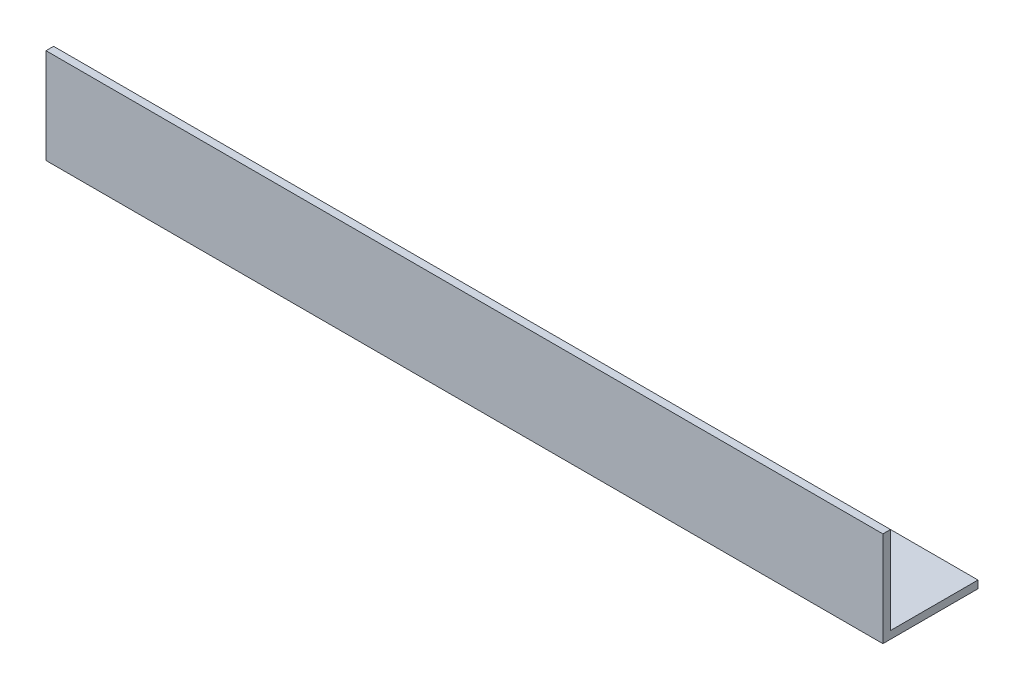
ISO-10303-21;
HEADER;
FILE_DESCRIPTION(('STEP AP214'),'2;1');
FILE_NAME('part.step','',(''),(''),'','','');
FILE_SCHEMA(('AUTOMOTIVE_DESIGN { 1 0 10303 214 1 1 1 1 }'));
ENDSEC;
DATA;
#1=APPLICATION_CONTEXT('core data for automotive mechanical design processes');
#2=APPLICATION_PROTOCOL_DEFINITION('international standard','automotive_design',2000,#1);
#3=PRODUCT_CONTEXT('',#1,'mechanical');
#4=PRODUCT('Part','Part','',(#3));
#5=PRODUCT_RELATED_PRODUCT_CATEGORY('part','',(#4));
#6=PRODUCT_DEFINITION_FORMATION('','',#4);
#7=PRODUCT_DEFINITION_CONTEXT('part definition',#1,'design');
#8=PRODUCT_DEFINITION('design','',#6,#7);
#9=PRODUCT_DEFINITION_SHAPE('','',#8);
#10=(LENGTH_UNIT() NAMED_UNIT(*) SI_UNIT(.MILLI.,.METRE.));
#11=(NAMED_UNIT(*) PLANE_ANGLE_UNIT() SI_UNIT($,.RADIAN.));
#12=(NAMED_UNIT(*) SI_UNIT($,.STERADIAN.) SOLID_ANGLE_UNIT());
#13=UNCERTAINTY_MEASURE_WITH_UNIT(LENGTH_MEASURE(1.E-05),#10,'distance_accuracy_value','');
#14=(GEOMETRIC_REPRESENTATION_CONTEXT(3) GLOBAL_UNCERTAINTY_ASSIGNED_CONTEXT((#13)) GLOBAL_UNIT_ASSIGNED_CONTEXT((#10,
#11,#12)) REPRESENTATION_CONTEXT('',''));
#15=CARTESIAN_POINT('',(0.,0.,0.));
#16=DIRECTION('',(0.,0.,1.));
#17=DIRECTION('',(1.,0.,0.));
#18=AXIS2_PLACEMENT_3D('',#15,#16,#17);
#19=CARTESIAN_POINT('',(220.,2.,-25.));
#20=DIRECTION('',(0.,0.,-1.));
#21=DIRECTION('',(-1.,0.,0.));
#22=AXIS2_PLACEMENT_3D('',#19,#20,#21);
#23=PLANE('',#22);
#24=DIRECTION('',(0.,-1.,0.));
#25=VECTOR('',#24,1.);
#26=CARTESIAN_POINT('',(31.8984433861517,25.,-25.));
#27=LINE('',#26,#25);
#28=CARTESIAN_POINT('',(31.8984433861517,2.,-25.));
#29=VERTEX_POINT('',#28);
#30=CARTESIAN_POINT('',(31.8984433861517,0.,-25.));
#31=VERTEX_POINT('',#30);
#32=EDGE_CURVE('E173',#29,#31,#27,.T.);
#33=ORIENTED_EDGE('',*,*,#32,.F.);
#34=DIRECTION('',(-1.,0.,0.));
#35=VECTOR('',#34,1.);
#36=CARTESIAN_POINT('',(220.,2.,-25.));
#37=LINE('',#36,#35);
#38=CARTESIAN_POINT('',(40.,2.,-25.));
#39=VERTEX_POINT('',#38);
#40=EDGE_CURVE('E205',#39,#29,#37,.T.);
#41=ORIENTED_EDGE('',*,*,#40,.F.);
#42=DIRECTION('',(0.,-1.,0.));
#43=VECTOR('',#42,1.);
#44=CARTESIAN_POINT('',(40.,25.,-25.));
#45=LINE('',#44,#43);
#46=CARTESIAN_POINT('',(40.,0.,-25.));
#47=VERTEX_POINT('',#46);
#48=EDGE_CURVE('E195',#39,#47,#45,.T.);
#49=ORIENTED_EDGE('',*,*,#48,.T.);
#50=DIRECTION('',(-1.,0.,0.));
#51=VECTOR('',#50,1.);
#52=CARTESIAN_POINT('',(220.,0.,-25.));
#53=LINE('',#52,#51);
#54=EDGE_CURVE('E191',#47,#31,#53,.T.);
#55=ORIENTED_EDGE('',*,*,#54,.T.);
#56=EDGE_LOOP('',(#33,#41,#49,#55));
#57=FACE_BOUND('',#56,.T.);
#58=ADVANCED_FACE('F37',(#57),#23,.T.);
#59=DIRECTION('',(0.,-1.,0.));
#60=VECTOR('',#59,1.);
#61=CARTESIAN_POINT('',(71.8984433861517,25.,-25.));
#62=LINE('',#61,#60);
#63=CARTESIAN_POINT('',(71.8984433861517,2.,-25.));
#64=VERTEX_POINT('',#63);
#65=CARTESIAN_POINT('',(71.8984433861517,0.,-25.));
#66=VERTEX_POINT('',#65);
#67=EDGE_CURVE('E361',#64,#66,#62,.T.);
#68=ORIENTED_EDGE('',*,*,#67,.F.);
#69=CARTESIAN_POINT('',(80.,2.,-25.));
#70=VERTEX_POINT('',#69);
#71=EDGE_CURVE('E308',#70,#64,#37,.T.);
#72=ORIENTED_EDGE('',*,*,#71,.F.);
#73=DIRECTION('',(0.,-1.,0.));
#74=VECTOR('',#73,1.);
#75=CARTESIAN_POINT('',(80.,25.,-25.));
#76=LINE('',#75,#74);
#77=CARTESIAN_POINT('',(80.,0.,-25.));
#78=VERTEX_POINT('',#77);
#79=EDGE_CURVE('E253',#70,#78,#76,.T.);
#80=ORIENTED_EDGE('',*,*,#79,.T.);
#81=EDGE_CURVE('E196',#78,#66,#53,.T.);
#82=ORIENTED_EDGE('',*,*,#81,.T.);
#83=EDGE_LOOP('',(#68,#72,#80,#82));
#84=FACE_BOUND('',#83,.T.);
#85=ADVANCED_FACE('F371',(#84),#23,.T.);
#86=DIRECTION('',(0.,-1.,0.));
#87=VECTOR('',#86,1.);
#88=CARTESIAN_POINT('',(111.898443386152,25.,-25.));
#89=LINE('',#88,#87);
#90=CARTESIAN_POINT('',(111.898443386152,2.,-25.));
#91=VERTEX_POINT('',#90);
#92=CARTESIAN_POINT('',(111.898443386152,0.,-25.));
#93=VERTEX_POINT('',#92);
#94=EDGE_CURVE('E227',#91,#93,#89,.T.);
#95=ORIENTED_EDGE('',*,*,#94,.F.);
#96=CARTESIAN_POINT('',(120.,2.,-25.));
#97=VERTEX_POINT('',#96);
#98=EDGE_CURVE('E312',#97,#91,#37,.T.);
#99=ORIENTED_EDGE('',*,*,#98,.F.);
#100=DIRECTION('',(0.,-1.,0.));
#101=VECTOR('',#100,1.);
#102=CARTESIAN_POINT('',(120.,25.,-25.));
#103=LINE('',#102,#101);
#104=CARTESIAN_POINT('',(120.,0.,-25.));
#105=VERTEX_POINT('',#104);
#106=EDGE_CURVE('E229',#97,#105,#103,.T.);
#107=ORIENTED_EDGE('',*,*,#106,.T.);
#108=EDGE_CURVE('E201',#105,#93,#53,.T.);
#109=ORIENTED_EDGE('',*,*,#108,.T.);
#110=EDGE_LOOP('',(#95,#99,#107,#109));
#111=FACE_BOUND('',#110,.T.);
#112=ADVANCED_FACE('F225',(#111),#23,.T.);
#113=DIRECTION('',(0.,-1.,0.));
#114=VECTOR('',#113,1.);
#115=CARTESIAN_POINT('',(151.898443386152,25.,-25.));
#116=LINE('',#115,#114);
#117=CARTESIAN_POINT('',(151.898443386152,2.,-25.));
#118=VERTEX_POINT('',#117);
#119=CARTESIAN_POINT('',(151.898443386152,0.,-25.));
#120=VERTEX_POINT('',#119);
#121=EDGE_CURVE('E243',#118,#120,#116,.T.);
#122=ORIENTED_EDGE('',*,*,#121,.F.);
#123=CARTESIAN_POINT('',(160.,2.,-25.));
#124=VERTEX_POINT('',#123);
#125=EDGE_CURVE('E203',#124,#118,#37,.T.);
#126=ORIENTED_EDGE('',*,*,#125,.F.);
#127=DIRECTION('',(0.,-1.,0.));
#128=VECTOR('',#127,1.);
#129=CARTESIAN_POINT('',(160.,25.,-25.));
#130=LINE('',#129,#128);
#131=CARTESIAN_POINT('',(160.,0.,-25.));
#132=VERTEX_POINT('',#131);
#133=EDGE_CURVE('E259',#124,#132,#130,.T.);
#134=ORIENTED_EDGE('',*,*,#133,.T.);
#135=EDGE_CURVE('E209',#132,#120,#53,.T.);
#136=ORIENTED_EDGE('',*,*,#135,.T.);
#137=EDGE_LOOP('',(#122,#126,#134,#136));
#138=FACE_BOUND('',#137,.T.);
#139=ADVANCED_FACE('F327',(#138),#23,.T.);
#140=CARTESIAN_POINT('',(220.,0.,0.));
#141=DIRECTION('',(0.,1.,0.));
#142=DIRECTION('',(0.,0.,1.));
#143=AXIS2_PLACEMENT_3D('',#140,#141,#142);
#144=PLANE('',#143);
#145=DIRECTION('',(0.,0.,-1.));
#146=VECTOR('',#145,1.);
#147=CARTESIAN_POINT('',(0.,0.,0.));
#148=LINE('',#147,#146);
#149=CARTESIAN_POINT('',(0.,0.,0.));
#150=VERTEX_POINT('',#149);
#151=CARTESIAN_POINT('',(0.,0.,-25.));
#152=VERTEX_POINT('',#151);
#153=EDGE_CURVE('E266',#150,#152,#148,.T.);
#154=ORIENTED_EDGE('',*,*,#153,.T.);
#155=DIRECTION('',(-0.904526644147777,0.,-0.426417108037144));
#156=VECTOR('',#155,1.);
#157=CARTESIAN_POINT('',(0.,0.,-25.));
#158=LINE('',#157,#156);
#159=CARTESIAN_POINT('',(14.4449828570791,0.,-18.1902638187456));
#160=VERTEX_POINT('',#159);
#161=EDGE_CURVE('E185',#160,#152,#158,.T.);
#162=ORIENTED_EDGE('',*,*,#161,.F.);
#163=DIRECTION('',(-0.931602389264283,0.,0.363479006707511));
#164=VECTOR('',#163,1.);
#165=CARTESIAN_POINT('',(14.4449828570791,0.,-18.1902638187456));
#166=LINE('',#165,#164);
#167=EDGE_CURVE('E177',#31,#160,#166,.T.);
#168=ORIENTED_EDGE('',*,*,#167,.F.);
#169=ORIENTED_EDGE('',*,*,#54,.F.);
#170=DIRECTION('',(-0.904526644147777,0.,-0.426417108037144));
#171=VECTOR('',#170,1.);
#172=CARTESIAN_POINT('',(40.,0.,-25.));
#173=LINE('',#172,#171);
#174=CARTESIAN_POINT('',(54.4449828570791,0.,-18.1902638187456));
#175=VERTEX_POINT('',#174);
#176=EDGE_CURVE('E363',#175,#47,#173,.T.);
#177=ORIENTED_EDGE('',*,*,#176,.F.);
#178=DIRECTION('',(-0.931602389264283,0.,0.363479006707511));
#179=VECTOR('',#178,1.);
#180=CARTESIAN_POINT('',(54.4449828570791,0.,-18.1902638187456));
#181=LINE('',#180,#179);
#182=EDGE_CURVE('E192',#66,#175,#181,.T.);
#183=ORIENTED_EDGE('',*,*,#182,.F.);
#184=ORIENTED_EDGE('',*,*,#81,.F.);
#185=DIRECTION('',(-0.904526644147777,0.,-0.426417108037144));
#186=VECTOR('',#185,1.);
#187=CARTESIAN_POINT('',(80.,0.,-25.));
#188=LINE('',#187,#186);
#189=CARTESIAN_POINT('',(94.4449828570791,0.,-18.1902638187456));
#190=VERTEX_POINT('',#189);
#191=EDGE_CURVE('E237',#190,#78,#188,.T.);
#192=ORIENTED_EDGE('',*,*,#191,.F.);
#193=DIRECTION('',(-0.931602389264283,0.,0.363479006707511));
#194=VECTOR('',#193,1.);
#195=CARTESIAN_POINT('',(94.4449828570791,0.,-18.1902638187456));
#196=LINE('',#195,#194);
#197=EDGE_CURVE('E235',#93,#190,#196,.T.);
#198=ORIENTED_EDGE('',*,*,#197,.F.);
#199=ORIENTED_EDGE('',*,*,#108,.F.);
#200=DIRECTION('',(-0.904526644147777,0.,-0.426417108037144));
#201=VECTOR('',#200,1.);
#202=CARTESIAN_POINT('',(120.,0.,-25.));
#203=LINE('',#202,#201);
#204=CARTESIAN_POINT('',(134.444982857079,0.,-18.1902638187456));
#205=VERTEX_POINT('',#204);
#206=EDGE_CURVE('E233',#205,#105,#203,.T.);
#207=ORIENTED_EDGE('',*,*,#206,.F.);
#208=DIRECTION('',(-0.931602389264283,0.,0.363479006707511));
#209=VECTOR('',#208,1.);
#210=CARTESIAN_POINT('',(134.444982857079,0.,-18.1902638187456));
#211=LINE('',#210,#209);
#212=EDGE_CURVE('E250',#120,#205,#211,.T.);
#213=ORIENTED_EDGE('',*,*,#212,.F.);
#214=ORIENTED_EDGE('',*,*,#135,.F.);
#215=DIRECTION('',(-0.904526644147777,0.,-0.426417108037144));
#216=VECTOR('',#215,1.);
#217=CARTESIAN_POINT('',(160.,0.,-25.));
#218=LINE('',#217,#216);
#219=CARTESIAN_POINT('',(174.444982857079,0.,-18.1902638187456));
#220=VERTEX_POINT('',#219);
#221=EDGE_CURVE('E256',#220,#132,#218,.T.);
#222=ORIENTED_EDGE('',*,*,#221,.F.);
#223=DIRECTION('',(-0.931602389264283,0.,0.363479006707511));
#224=VECTOR('',#223,1.);
#225=CARTESIAN_POINT('',(174.444982857079,0.,-18.1902638187456));
#226=LINE('',#225,#224);
#227=CARTESIAN_POINT('',(191.898443386152,0.,-25.));
#228=VERTEX_POINT('',#227);
#229=EDGE_CURVE('E248',#228,#220,#226,.T.);
#230=ORIENTED_EDGE('',*,*,#229,.F.);
#231=CARTESIAN_POINT('',(220.,0.,-25.));
#232=VERTEX_POINT('',#231);
#233=EDGE_CURVE('E199',#232,#228,#53,.T.);
#234=ORIENTED_EDGE('',*,*,#233,.F.);
#235=DIRECTION('',(0.,0.,-1.));
#236=VECTOR('',#235,1.);
#237=CARTESIAN_POINT('',(220.,0.,0.));
#238=LINE('',#237,#236);
#239=CARTESIAN_POINT('',(220.,0.,0.));
#240=VERTEX_POINT('',#239);
#241=EDGE_CURVE('E267',#240,#232,#238,.T.);
#242=ORIENTED_EDGE('',*,*,#241,.F.);
#243=DIRECTION('',(-1.,0.,0.));
#244=VECTOR('',#243,1.);
#245=CARTESIAN_POINT('',(220.,0.,0.));
#246=LINE('',#245,#244);
#247=EDGE_CURVE('E283',#240,#150,#246,.T.);
#248=ORIENTED_EDGE('',*,*,#247,.T.);
#249=EDGE_LOOP('',(#154,#162,#168,#169,#177,#183,#184,#192,#198,#199,#207,#213,#214,#222,#230,
#234,#242,#248));
#250=FACE_BOUND('',#249,.T.);
#251=ADVANCED_FACE('F39',(#250),#144,.F.);
#252=DIRECTION('',(0.,-1.,0.));
#253=VECTOR('',#252,1.);
#254=CARTESIAN_POINT('',(191.898443386152,25.,-25.));
#255=LINE('',#254,#253);
#256=CARTESIAN_POINT('',(191.898443386152,2.,-25.));
#257=VERTEX_POINT('',#256);
#258=EDGE_CURVE('E254',#257,#228,#255,.T.);
#259=ORIENTED_EDGE('',*,*,#258,.F.);
#260=CARTESIAN_POINT('',(220.,2.,-25.));
#261=VERTEX_POINT('',#260);
#262=EDGE_CURVE('E197',#261,#257,#37,.T.);
#263=ORIENTED_EDGE('',*,*,#262,.F.);
#264=DIRECTION('',(0.,-1.,0.));
#265=VECTOR('',#264,1.);
#266=CARTESIAN_POINT('',(220.,2.,-25.));
#267=LINE('',#266,#265);
#268=EDGE_CURVE('E269',#261,#232,#267,.T.);
#269=ORIENTED_EDGE('',*,*,#268,.T.);
#270=ORIENTED_EDGE('',*,*,#233,.T.);
#271=EDGE_LOOP('',(#259,#263,#269,#270));
#272=FACE_BOUND('',#271,.T.);
#273=ADVANCED_FACE('F336',(#272),#23,.T.);
#274=CARTESIAN_POINT('',(220.,2.,0.));
#275=DIRECTION('',(0.,1.,0.));
#276=DIRECTION('',(0.,0.,1.));
#277=AXIS2_PLACEMENT_3D('',#274,#275,#276);
#278=PLANE('',#277);
#279=DIRECTION('',(0.904526644147777,0.,0.426417108037144));
#280=VECTOR('',#279,1.);
#281=CARTESIAN_POINT('',(189.639699887613,2.,64.4010286134773));
#282=LINE('',#281,#280);
#283=CARTESIAN_POINT('',(0.,2.,-25.));
#284=VERTEX_POINT('',#283);
#285=CARTESIAN_POINT('',(14.4449828570791,2.,-18.1902638187456));
#286=VERTEX_POINT('',#285);
#287=EDGE_CURVE('E264',#284,#286,#282,.T.);
#288=ORIENTED_EDGE('',*,*,#287,.F.);
#289=DIRECTION('',(0.,0.,-1.));
#290=VECTOR('',#289,1.);
#291=CARTESIAN_POINT('',(0.,2.,0.));
#292=LINE('',#291,#290);
#293=CARTESIAN_POINT('',(0.,2.,-2.));
#294=VERTEX_POINT('',#293);
#295=EDGE_CURVE('E288',#294,#284,#292,.T.);
#296=ORIENTED_EDGE('',*,*,#295,.F.);
#297=DIRECTION('',(-1.,0.,0.));
#298=VECTOR('',#297,1.);
#299=CARTESIAN_POINT('',(220.,2.,-2.));
#300=LINE('',#299,#298);
#301=CARTESIAN_POINT('',(220.,2.,-2.));
#302=VERTEX_POINT('',#301);
#303=EDGE_CURVE('E304',#302,#294,#300,.T.);
#304=ORIENTED_EDGE('',*,*,#303,.F.);
#305=DIRECTION('',(0.,0.,-1.));
#306=VECTOR('',#305,1.);
#307=CARTESIAN_POINT('',(220.,2.,0.));
#308=LINE('',#307,#306);
#309=EDGE_CURVE('E272',#302,#261,#308,.T.);
#310=ORIENTED_EDGE('',*,*,#309,.T.);
#311=ORIENTED_EDGE('',*,*,#262,.T.);
#312=DIRECTION('',(0.931602389264283,0.,-0.363479006707511));
#313=VECTOR('',#312,1.);
#314=CARTESIAN_POINT('',(207.821859195753,2.,-31.2127656912038));
#315=LINE('',#314,#313);
#316=CARTESIAN_POINT('',(174.444982857079,2.,-18.1902638187456));
#317=VERTEX_POINT('',#316);
#318=EDGE_CURVE('E208',#317,#257,#315,.T.);
#319=ORIENTED_EDGE('',*,*,#318,.F.);
#320=DIRECTION('',(0.904526644147777,0.,0.426417108037144));
#321=VECTOR('',#320,1.);
#322=CARTESIAN_POINT('',(218.732747891895,2.,2.68812689507127));
#323=LINE('',#322,#321);
#324=EDGE_CURVE('E214',#124,#317,#323,.T.);
#325=ORIENTED_EDGE('',*,*,#324,.F.);
#326=ORIENTED_EDGE('',*,*,#125,.T.);
#327=DIRECTION('',(0.931602389264283,0.,-0.363479006707511));
#328=VECTOR('',#327,1.);
#329=CARTESIAN_POINT('',(202.53717966307,2.,-44.7574821350488));
#330=LINE('',#329,#328);
#331=CARTESIAN_POINT('',(134.444982857079,2.,-18.1902638187456));
#332=VERTEX_POINT('',#331);
#333=EDGE_CURVE('E324',#332,#118,#330,.T.);
#334=ORIENTED_EDGE('',*,*,#333,.F.);
#335=DIRECTION('',(0.904526644147777,0.,0.426417108037144));
#336=VECTOR('',#335,1.);
#337=CARTESIAN_POINT('',(211.459485890825,2.,18.1163523246728));
#338=LINE('',#337,#336);
#339=EDGE_CURVE('E382',#97,#332,#338,.T.);
#340=ORIENTED_EDGE('',*,*,#339,.F.);
#341=ORIENTED_EDGE('',*,*,#98,.T.);
#342=DIRECTION('',(0.931602389264283,0.,-0.363479006707511));
#343=VECTOR('',#342,1.);
#344=CARTESIAN_POINT('',(197.252500130387,2.,-58.3021985788939));
#345=LINE('',#344,#343);
#346=CARTESIAN_POINT('',(94.4449828570791,2.,-18.1902638187455));
#347=VERTEX_POINT('',#346);
#348=EDGE_CURVE('E378',#347,#91,#345,.T.);
#349=ORIENTED_EDGE('',*,*,#348,.F.);
#350=DIRECTION('',(0.904526644147777,0.,0.426417108037144));
#351=VECTOR('',#350,1.);
#352=CARTESIAN_POINT('',(204.186223889754,2.,33.5445777542743));
#353=LINE('',#352,#351);
#354=EDGE_CURVE('E376',#70,#347,#353,.T.);
#355=ORIENTED_EDGE('',*,*,#354,.F.);
#356=ORIENTED_EDGE('',*,*,#71,.T.);
#357=DIRECTION('',(0.931602389264284,0.,-0.363479006707511));
#358=VECTOR('',#357,1.);
#359=CARTESIAN_POINT('',(191.967820597704,2.,-71.8469150227389));
#360=LINE('',#359,#358);
#361=CARTESIAN_POINT('',(54.4449828570791,2.,-18.1902638187456));
#362=VERTEX_POINT('',#361);
#363=EDGE_CURVE('E375',#362,#64,#360,.T.);
#364=ORIENTED_EDGE('',*,*,#363,.F.);
#365=DIRECTION('',(0.904526644147777,0.,0.426417108037144));
#366=VECTOR('',#365,1.);
#367=CARTESIAN_POINT('',(196.912961888684,2.,48.9728031838758));
#368=LINE('',#367,#366);
#369=EDGE_CURVE('E45',#39,#362,#368,.T.);
#370=ORIENTED_EDGE('',*,*,#369,.F.);
#371=ORIENTED_EDGE('',*,*,#40,.T.);
#372=DIRECTION('',(0.931602389264283,0.,-0.363479006707511));
#373=VECTOR('',#372,1.);
#374=CARTESIAN_POINT('',(186.683141065021,2.,-85.3916314665839));
#375=LINE('',#374,#373);
#376=EDGE_CURVE('E11',#286,#29,#375,.T.);
#377=ORIENTED_EDGE('',*,*,#376,.F.);
#378=EDGE_LOOP('',(#288,#296,#304,#310,#311,#319,#325,#326,#334,#340,#341,#349,#355,#356,#364,
#370,#371,#377));
#379=FACE_BOUND('',#378,.T.);
#380=ADVANCED_FACE('F323',(#379),#278,.T.);
#381=CARTESIAN_POINT('',(220.,25.,-2.));
#382=DIRECTION('',(0.,0.,-1.));
#383=DIRECTION('',(0.,1.,0.));
#384=AXIS2_PLACEMENT_3D('',#381,#382,#383);
#385=PLANE('',#384);
#386=DIRECTION('',(0.,-1.,0.));
#387=VECTOR('',#386,1.);
#388=CARTESIAN_POINT('',(0.,25.,-2.));
#389=LINE('',#388,#387);
#390=CARTESIAN_POINT('',(0.,25.,-2.));
#391=VERTEX_POINT('',#390);
#392=EDGE_CURVE('E291',#391,#294,#389,.T.);
#393=ORIENTED_EDGE('',*,*,#392,.F.);
#394=DIRECTION('',(-1.,0.,0.));
#395=VECTOR('',#394,1.);
#396=CARTESIAN_POINT('',(220.,25.,-2.));
#397=LINE('',#396,#395);
#398=CARTESIAN_POINT('',(220.,25.,-2.));
#399=VERTEX_POINT('',#398);
#400=EDGE_CURVE('E302',#399,#391,#397,.T.);
#401=ORIENTED_EDGE('',*,*,#400,.F.);
#402=DIRECTION('',(0.,-1.,0.));
#403=VECTOR('',#402,1.);
#404=CARTESIAN_POINT('',(220.,25.,-2.));
#405=LINE('',#404,#403);
#406=EDGE_CURVE('E275',#399,#302,#405,.T.);
#407=ORIENTED_EDGE('',*,*,#406,.T.);
#408=ORIENTED_EDGE('',*,*,#303,.T.);
#409=EDGE_LOOP('',(#393,#401,#407,#408));
#410=FACE_BOUND('',#409,.T.);
#411=ADVANCED_FACE('F343',(#410),#385,.T.);
#412=CARTESIAN_POINT('',(220.,25.,0.));
#413=DIRECTION('',(0.,1.,0.));
#414=DIRECTION('',(0.,0.,1.));
#415=AXIS2_PLACEMENT_3D('',#412,#413,#414);
#416=PLANE('',#415);
#417=DIRECTION('',(0.,0.,-1.));
#418=VECTOR('',#417,1.);
#419=CARTESIAN_POINT('',(0.,25.,0.));
#420=LINE('',#419,#418);
#421=CARTESIAN_POINT('',(0.,25.,0.));
#422=VERTEX_POINT('',#421);
#423=EDGE_CURVE('E294',#422,#391,#420,.T.);
#424=ORIENTED_EDGE('',*,*,#423,.F.);
#425=DIRECTION('',(-1.,0.,0.));
#426=VECTOR('',#425,1.);
#427=CARTESIAN_POINT('',(220.,25.,0.));
#428=LINE('',#427,#426);
#429=CARTESIAN_POINT('',(220.,25.,0.));
#430=VERTEX_POINT('',#429);
#431=EDGE_CURVE('E300',#430,#422,#428,.T.);
#432=ORIENTED_EDGE('',*,*,#431,.F.);
#433=DIRECTION('',(0.,0.,-1.));
#434=VECTOR('',#433,1.);
#435=CARTESIAN_POINT('',(220.,25.,0.));
#436=LINE('',#435,#434);
#437=EDGE_CURVE('E278',#430,#399,#436,.T.);
#438=ORIENTED_EDGE('',*,*,#437,.T.);
#439=ORIENTED_EDGE('',*,*,#400,.T.);
#440=EDGE_LOOP('',(#424,#432,#438,#439));
#441=FACE_BOUND('',#440,.T.);
#442=ADVANCED_FACE('F346',(#441),#416,.T.);
#443=CARTESIAN_POINT('',(220.,25.,0.));
#444=DIRECTION('',(0.,0.,-1.));
#445=DIRECTION('',(0.,1.,0.));
#446=AXIS2_PLACEMENT_3D('',#443,#444,#445);
#447=PLANE('',#446);
#448=DIRECTION('',(0.,-1.,0.));
#449=VECTOR('',#448,1.);
#450=CARTESIAN_POINT('',(0.,25.,0.));
#451=LINE('',#450,#449);
#452=EDGE_CURVE('E270',#422,#150,#451,.T.);
#453=ORIENTED_EDGE('',*,*,#452,.T.);
#454=ORIENTED_EDGE('',*,*,#247,.F.);
#455=DIRECTION('',(0.,-1.,0.));
#456=VECTOR('',#455,1.);
#457=CARTESIAN_POINT('',(220.,25.,0.));
#458=LINE('',#457,#456);
#459=EDGE_CURVE('E281',#430,#240,#458,.T.);
#460=ORIENTED_EDGE('',*,*,#459,.F.);
#461=ORIENTED_EDGE('',*,*,#431,.T.);
#462=EDGE_LOOP('',(#453,#454,#460,#461));
#463=FACE_BOUND('',#462,.T.);
#464=ADVANCED_FACE('F351',(#463),#447,.F.);
#465=CARTESIAN_POINT('',(220.,0.,0.));
#466=DIRECTION('',(-1.,0.,0.));
#467=DIRECTION('',(0.,0.,1.));
#468=AXIS2_PLACEMENT_3D('',#465,#466,#467);
#469=PLANE('',#468);
#470=ORIENTED_EDGE('',*,*,#241,.T.);
#471=ORIENTED_EDGE('',*,*,#268,.F.);
#472=ORIENTED_EDGE('',*,*,#309,.F.);
#473=ORIENTED_EDGE('',*,*,#406,.F.);
#474=ORIENTED_EDGE('',*,*,#437,.F.);
#475=ORIENTED_EDGE('',*,*,#459,.T.);
#476=EDGE_LOOP('',(#470,#471,#472,#473,#474,#475));
#477=FACE_BOUND('',#476,.T.);
#478=ADVANCED_FACE('F341',(#477),#469,.F.);
#479=CARTESIAN_POINT('',(0.,0.,0.));
#480=DIRECTION('',(-1.,0.,0.));
#481=DIRECTION('',(0.,0.,1.));
#482=AXIS2_PLACEMENT_3D('',#479,#480,#481);
#483=PLANE('',#482);
#484=ORIENTED_EDGE('',*,*,#153,.F.);
#485=ORIENTED_EDGE('',*,*,#452,.F.);
#486=ORIENTED_EDGE('',*,*,#423,.T.);
#487=ORIENTED_EDGE('',*,*,#392,.T.);
#488=ORIENTED_EDGE('',*,*,#295,.T.);
#489=DIRECTION('',(0.,-1.,0.));
#490=VECTOR('',#489,1.);
#491=CARTESIAN_POINT('',(0.,2.,-25.));
#492=LINE('',#491,#490);
#493=EDGE_CURVE('E285',#284,#152,#492,.T.);
#494=ORIENTED_EDGE('',*,*,#493,.T.);
#495=EDGE_LOOP('',(#484,#485,#486,#487,#488,#494));
#496=FACE_BOUND('',#495,.T.);
#497=ADVANCED_FACE('F355',(#496),#483,.T.);
#498=CARTESIAN_POINT('',(0.,25.,-25.));
#499=DIRECTION('',(-0.426417108037144,0.,0.904526644147777));
#500=DIRECTION('',(0.904526644147777,0.,0.426417108037144));
#501=AXIS2_PLACEMENT_3D('',#498,#499,#500);
#502=PLANE('',#501);
#503=ORIENTED_EDGE('',*,*,#287,.T.);
#504=DIRECTION('',(0.,-1.,0.));
#505=VECTOR('',#504,1.);
#506=CARTESIAN_POINT('',(14.4449828570791,25.,-18.1902638187456));
#507=LINE('',#506,#505);
#508=EDGE_CURVE('E184',#286,#160,#507,.T.);
#509=ORIENTED_EDGE('',*,*,#508,.T.);
#510=ORIENTED_EDGE('',*,*,#161,.T.);
#511=ORIENTED_EDGE('',*,*,#493,.F.);
#512=EDGE_LOOP('',(#503,#509,#510,#511));
#513=FACE_BOUND('',#512,.T.);
#514=ADVANCED_FACE('F357',(#513),#502,.F.);
#515=CARTESIAN_POINT('',(14.4449828570791,25.,-18.1902638187456));
#516=DIRECTION('',(0.363479006707511,0.,0.931602389264283));
#517=DIRECTION('',(0.931602389264283,0.,-0.363479006707511));
#518=AXIS2_PLACEMENT_3D('',#515,#516,#517);
#519=PLANE('',#518);
#520=ORIENTED_EDGE('',*,*,#376,.T.);
#521=ORIENTED_EDGE('',*,*,#32,.T.);
#522=ORIENTED_EDGE('',*,*,#167,.T.);
#523=ORIENTED_EDGE('',*,*,#508,.F.);
#524=EDGE_LOOP('',(#520,#521,#522,#523));
#525=FACE_BOUND('',#524,.T.);
#526=ADVANCED_FACE('F175',(#525),#519,.F.);
#527=CARTESIAN_POINT('',(160.,25.,-25.));
#528=DIRECTION('',(-0.426417108037144,0.,0.904526644147777));
#529=DIRECTION('',(0.904526644147777,0.,0.426417108037144));
#530=AXIS2_PLACEMENT_3D('',#527,#528,#529);
#531=PLANE('',#530);
#532=ORIENTED_EDGE('',*,*,#324,.T.);
#533=DIRECTION('',(0.,-1.,0.));
#534=VECTOR('',#533,1.);
#535=CARTESIAN_POINT('',(174.444982857079,25.,-18.1902638187456));
#536=LINE('',#535,#534);
#537=EDGE_CURVE('E257',#317,#220,#536,.T.);
#538=ORIENTED_EDGE('',*,*,#537,.T.);
#539=ORIENTED_EDGE('',*,*,#221,.T.);
#540=ORIENTED_EDGE('',*,*,#133,.F.);
#541=EDGE_LOOP('',(#532,#538,#539,#540));
#542=FACE_BOUND('',#541,.T.);
#543=ADVANCED_FACE('F333',(#542),#531,.F.);
#544=CARTESIAN_POINT('',(174.444982857079,25.,-18.1902638187456));
#545=DIRECTION('',(0.363479006707511,0.,0.931602389264283));
#546=DIRECTION('',(0.931602389264283,0.,-0.363479006707511));
#547=AXIS2_PLACEMENT_3D('',#544,#545,#546);
#548=PLANE('',#547);
#549=ORIENTED_EDGE('',*,*,#318,.T.);
#550=ORIENTED_EDGE('',*,*,#258,.T.);
#551=ORIENTED_EDGE('',*,*,#229,.T.);
#552=ORIENTED_EDGE('',*,*,#537,.F.);
#553=EDGE_LOOP('',(#549,#550,#551,#552));
#554=FACE_BOUND('',#553,.T.);
#555=ADVANCED_FACE('F335',(#554),#548,.F.);
#556=CARTESIAN_POINT('',(120.,25.,-25.));
#557=DIRECTION('',(-0.426417108037144,0.,0.904526644147777));
#558=DIRECTION('',(0.904526644147777,0.,0.426417108037144));
#559=AXIS2_PLACEMENT_3D('',#556,#557,#558);
#560=PLANE('',#559);
#561=ORIENTED_EDGE('',*,*,#339,.T.);
#562=DIRECTION('',(0.,-1.,0.));
#563=VECTOR('',#562,1.);
#564=CARTESIAN_POINT('',(134.444982857079,25.,-18.1902638187456));
#565=LINE('',#564,#563);
#566=EDGE_CURVE('E245',#332,#205,#565,.T.);
#567=ORIENTED_EDGE('',*,*,#566,.T.);
#568=ORIENTED_EDGE('',*,*,#206,.T.);
#569=ORIENTED_EDGE('',*,*,#106,.F.);
#570=EDGE_LOOP('',(#561,#567,#568,#569));
#571=FACE_BOUND('',#570,.T.);
#572=ADVANCED_FACE('F387',(#571),#560,.F.);
#573=CARTESIAN_POINT('',(134.444982857079,25.,-18.1902638187456));
#574=DIRECTION('',(0.363479006707511,0.,0.931602389264283));
#575=DIRECTION('',(0.931602389264283,0.,-0.363479006707511));
#576=AXIS2_PLACEMENT_3D('',#573,#574,#575);
#577=PLANE('',#576);
#578=ORIENTED_EDGE('',*,*,#333,.T.);
#579=ORIENTED_EDGE('',*,*,#121,.T.);
#580=ORIENTED_EDGE('',*,*,#212,.T.);
#581=ORIENTED_EDGE('',*,*,#566,.F.);
#582=EDGE_LOOP('',(#578,#579,#580,#581));
#583=FACE_BOUND('',#582,.T.);
#584=ADVANCED_FACE('F329',(#583),#577,.F.);
#585=CARTESIAN_POINT('',(80.,25.,-25.));
#586=DIRECTION('',(-0.426417108037144,0.,0.904526644147777));
#587=DIRECTION('',(0.904526644147777,0.,0.426417108037144));
#588=AXIS2_PLACEMENT_3D('',#585,#586,#587);
#589=PLANE('',#588);
#590=ORIENTED_EDGE('',*,*,#354,.T.);
#591=DIRECTION('',(0.,-1.,0.));
#592=VECTOR('',#591,1.);
#593=CARTESIAN_POINT('',(94.4449828570791,25.,-18.1902638187456));
#594=LINE('',#593,#592);
#595=EDGE_CURVE('E60',#347,#190,#594,.T.);
#596=ORIENTED_EDGE('',*,*,#595,.T.);
#597=ORIENTED_EDGE('',*,*,#191,.T.);
#598=ORIENTED_EDGE('',*,*,#79,.F.);
#599=EDGE_LOOP('',(#590,#596,#597,#598));
#600=FACE_BOUND('',#599,.T.);
#601=ADVANCED_FACE('F394',(#600),#589,.F.);
#602=CARTESIAN_POINT('',(94.4449828570791,25.,-18.1902638187456));
#603=DIRECTION('',(0.363479006707511,0.,0.931602389264283));
#604=DIRECTION('',(0.931602389264283,0.,-0.363479006707511));
#605=AXIS2_PLACEMENT_3D('',#602,#603,#604);
#606=PLANE('',#605);
#607=ORIENTED_EDGE('',*,*,#348,.T.);
#608=ORIENTED_EDGE('',*,*,#94,.T.);
#609=ORIENTED_EDGE('',*,*,#197,.T.);
#610=ORIENTED_EDGE('',*,*,#595,.F.);
#611=EDGE_LOOP('',(#607,#608,#609,#610));
#612=FACE_BOUND('',#611,.T.);
#613=ADVANCED_FACE('F534',(#612),#606,.F.);
#614=CARTESIAN_POINT('',(40.,25.,-25.));
#615=DIRECTION('',(-0.426417108037144,0.,0.904526644147777));
#616=DIRECTION('',(0.904526644147777,0.,0.426417108037144));
#617=AXIS2_PLACEMENT_3D('',#614,#615,#616);
#618=PLANE('',#617);
#619=ORIENTED_EDGE('',*,*,#369,.T.);
#620=DIRECTION('',(0.,-1.,0.));
#621=VECTOR('',#620,1.);
#622=CARTESIAN_POINT('',(54.4449828570791,25.,-18.1902638187456));
#623=LINE('',#622,#621);
#624=EDGE_CURVE('E52',#362,#175,#623,.T.);
#625=ORIENTED_EDGE('',*,*,#624,.T.);
#626=ORIENTED_EDGE('',*,*,#176,.T.);
#627=ORIENTED_EDGE('',*,*,#48,.F.);
#628=EDGE_LOOP('',(#619,#625,#626,#627));
#629=FACE_BOUND('',#628,.T.);
#630=ADVANCED_FACE('F544',(#629),#618,.F.);
#631=CARTESIAN_POINT('',(54.4449828570791,25.,-18.1902638187456));
#632=DIRECTION('',(0.363479006707511,0.,0.931602389264283));
#633=DIRECTION('',(0.931602389264283,0.,-0.363479006707511));
#634=AXIS2_PLACEMENT_3D('',#631,#632,#633);
#635=PLANE('',#634);
#636=ORIENTED_EDGE('',*,*,#363,.T.);
#637=ORIENTED_EDGE('',*,*,#67,.T.);
#638=ORIENTED_EDGE('',*,*,#182,.T.);
#639=ORIENTED_EDGE('',*,*,#624,.F.);
#640=EDGE_LOOP('',(#636,#637,#638,#639));
#641=FACE_BOUND('',#640,.T.);
#642=ADVANCED_FACE('F374',(#641),#635,.F.);
#643=CLOSED_SHELL('',(#58,#85,#112,#139,#251,#273,#380,#411,#442,#464,#478,#497,#514,#526,#543,
#555,#572,#584,#601,#613,#630,#642));
#644=MANIFOLD_SOLID_BREP('B2',#643);
#645=ADVANCED_BREP_SHAPE_REPRESENTATION('',(#18,#644),#14);
#646=SHAPE_DEFINITION_REPRESENTATION(#9,#645);
ENDSEC;
END-ISO-10303-21;
